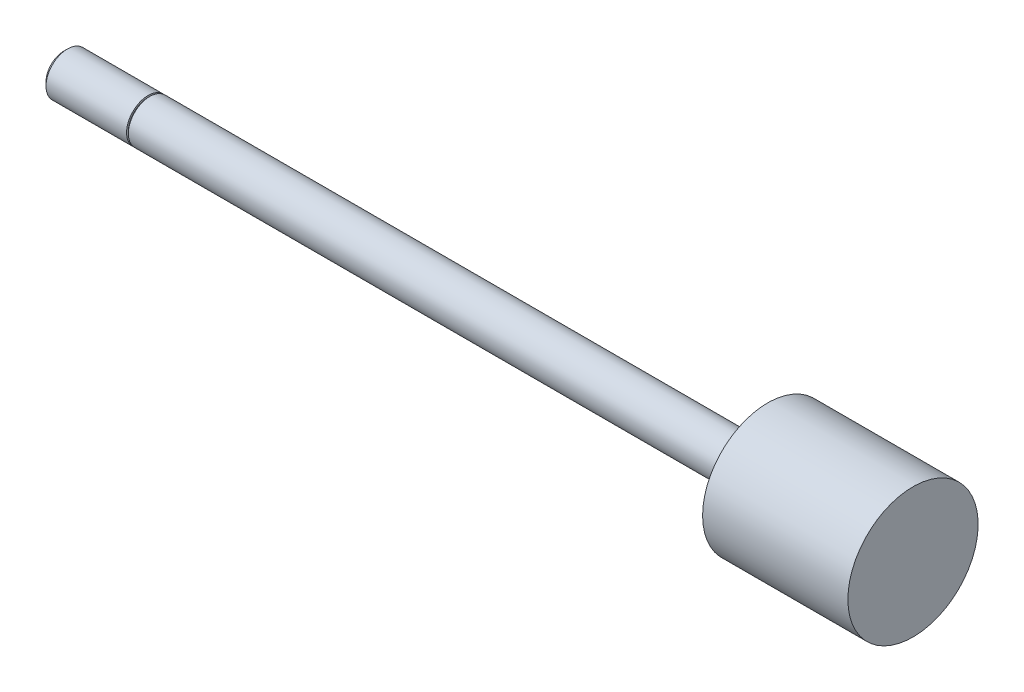
ISO-10303-21;
HEADER;
FILE_DESCRIPTION(('STEP AP214'),'2;1');
FILE_NAME('part.step','',(''),(''),'','','');
FILE_SCHEMA(('AUTOMOTIVE_DESIGN { 1 0 10303 214 1 1 1 1 }'));
ENDSEC;
DATA;
#1=APPLICATION_CONTEXT('core data for automotive mechanical design processes');
#2=APPLICATION_PROTOCOL_DEFINITION('international standard','automotive_design',2000,#1);
#3=PRODUCT_CONTEXT('',#1,'mechanical');
#4=PRODUCT('Part','Part','',(#3));
#5=PRODUCT_RELATED_PRODUCT_CATEGORY('part','',(#4));
#6=PRODUCT_DEFINITION_FORMATION('','',#4);
#7=PRODUCT_DEFINITION_CONTEXT('part definition',#1,'design');
#8=PRODUCT_DEFINITION('design','',#6,#7);
#9=PRODUCT_DEFINITION_SHAPE('','',#8);
#10=(LENGTH_UNIT() NAMED_UNIT(*) SI_UNIT(.MILLI.,.METRE.));
#11=(NAMED_UNIT(*) PLANE_ANGLE_UNIT() SI_UNIT($,.RADIAN.));
#12=(NAMED_UNIT(*) SI_UNIT($,.STERADIAN.) SOLID_ANGLE_UNIT());
#13=UNCERTAINTY_MEASURE_WITH_UNIT(LENGTH_MEASURE(1.E-05),#10,'distance_accuracy_value','');
#14=(GEOMETRIC_REPRESENTATION_CONTEXT(3) GLOBAL_UNCERTAINTY_ASSIGNED_CONTEXT((#13)) GLOBAL_UNIT_ASSIGNED_CONTEXT((#10,
#11,#12)) REPRESENTATION_CONTEXT('',''));
#15=CARTESIAN_POINT('',(0.,0.,0.));
#16=DIRECTION('',(0.,0.,1.));
#17=DIRECTION('',(1.,0.,0.));
#18=AXIS2_PLACEMENT_3D('',#15,#16,#17);
#19=CARTESIAN_POINT('',(112.7506,0.,0.));
#20=DIRECTION('',(-1.,0.,0.));
#21=DIRECTION('',(0.,0.,1.));
#22=AXIS2_PLACEMENT_3D('',#19,#20,#21);
#23=CYLINDRICAL_SURFACE('',#22,3.175);
#24=CARTESIAN_POINT('',(91.2876,0.,0.));
#25=DIRECTION('',(-1.,0.,0.));
#26=DIRECTION('',(0.,0.,1.));
#27=AXIS2_PLACEMENT_3D('',#24,#25,#26);
#28=CIRCLE('',#27,3.175);
#29=CARTESIAN_POINT('',(91.2876,0.,3.175));
#30=VERTEX_POINT('',#29);
#31=EDGE_CURVE('E10',#30,#30,#28,.T.);
#32=ORIENTED_EDGE('',*,*,#31,.T.);
#33=EDGE_LOOP('',(#32));
#34=FACE_BOUND('',#33,.T.);
#35=CARTESIAN_POINT('',(0.,0.,0.));
#36=DIRECTION('',(-1.,0.,0.));
#37=DIRECTION('',(0.,0.,1.));
#38=AXIS2_PLACEMENT_3D('',#35,#36,#37);
#39=CIRCLE('',#38,3.175);
#40=CARTESIAN_POINT('',(0.,0.,3.175));
#41=VERTEX_POINT('',#40);
#42=EDGE_CURVE('E50',#41,#41,#39,.T.);
#43=ORIENTED_EDGE('',*,*,#42,.F.);
#44=EDGE_LOOP('',(#43));
#45=FACE_BOUND('',#44,.T.);
#46=ADVANCED_FACE('F34',(#34,#45),#23,.T.);
#47=CARTESIAN_POINT('',(91.2876,3.175,0.));
#48=DIRECTION('',(1.,0.,0.));
#49=DIRECTION('',(0.,0.,-1.));
#50=AXIS2_PLACEMENT_3D('',#47,#48,#49);
#51=PLANE('',#50);
#52=ORIENTED_EDGE('',*,*,#31,.F.);
#53=EDGE_LOOP('',(#52));
#54=FACE_BOUND('',#53,.T.);
#55=CARTESIAN_POINT('',(91.2876,0.,0.));
#56=DIRECTION('',(-1.,0.,0.));
#57=DIRECTION('',(0.,0.,1.));
#58=AXIS2_PLACEMENT_3D('',#55,#56,#57);
#59=CIRCLE('',#58,9.62025);
#60=CARTESIAN_POINT('',(91.2876,0.,9.62025));
#61=VERTEX_POINT('',#60);
#62=EDGE_CURVE('E42',#61,#61,#59,.T.);
#63=ORIENTED_EDGE('',*,*,#62,.T.);
#64=EDGE_LOOP('',(#63));
#65=FACE_BOUND('',#64,.T.);
#66=ADVANCED_FACE('F84',(#54,#65),#51,.F.);
#67=CARTESIAN_POINT('',(112.7506,0.,0.));
#68=DIRECTION('',(-1.,0.,0.));
#69=DIRECTION('',(0.,0.,1.));
#70=AXIS2_PLACEMENT_3D('',#67,#68,#69);
#71=CYLINDRICAL_SURFACE('',#70,9.62025);
#72=ORIENTED_EDGE('',*,*,#62,.F.);
#73=EDGE_LOOP('',(#72));
#74=FACE_BOUND('',#73,.T.);
#75=CARTESIAN_POINT('',(112.7506,0.,0.));
#76=DIRECTION('',(-1.,0.,0.));
#77=DIRECTION('',(0.,0.,1.));
#78=AXIS2_PLACEMENT_3D('',#75,#76,#77);
#79=CIRCLE('',#78,9.62025);
#80=CARTESIAN_POINT('',(112.7506,0.,9.62025));
#81=VERTEX_POINT('',#80);
#82=EDGE_CURVE('E47',#81,#81,#79,.T.);
#83=ORIENTED_EDGE('',*,*,#82,.T.);
#84=EDGE_LOOP('',(#83));
#85=FACE_BOUND('',#84,.T.);
#86=ADVANCED_FACE('F72',(#74,#85),#71,.T.);
#87=CARTESIAN_POINT('',(112.7506,9.62025,0.));
#88=DIRECTION('',(-1.,0.,0.));
#89=DIRECTION('',(0.,0.,1.));
#90=AXIS2_PLACEMENT_3D('',#87,#88,#89);
#91=PLANE('',#90);
#92=ORIENTED_EDGE('',*,*,#82,.F.);
#93=EDGE_LOOP('',(#92));
#94=FACE_BOUND('',#93,.T.);
#95=ADVANCED_FACE('F74',(#94),#91,.F.);
#96=CARTESIAN_POINT('',(-0.254,3.429,0.));
#97=DIRECTION('',(1.,0.,0.));
#98=DIRECTION('',(0.,0.,-1.));
#99=AXIS2_PLACEMENT_3D('',#96,#97,#98);
#100=PLANE('',#99);
#101=CARTESIAN_POINT('',(-0.254,0.,0.));
#102=DIRECTION('',(-1.,0.,0.));
#103=DIRECTION('',(0.,0.,1.));
#104=AXIS2_PLACEMENT_3D('',#101,#102,#103);
#105=CIRCLE('',#104,2.921);
#106=CARTESIAN_POINT('',(-0.254,0.,2.921));
#107=VERTEX_POINT('',#106);
#108=EDGE_CURVE('E52',#107,#107,#105,.T.);
#109=ORIENTED_EDGE('',*,*,#108,.T.);
#110=EDGE_LOOP('',(#109));
#111=FACE_BOUND('',#110,.T.);
#112=CARTESIAN_POINT('',(-0.254000000000004,0.,0.));
#113=DIRECTION('',(1.,0.,0.));
#114=DIRECTION('',(0.,0.,-1.));
#115=AXIS2_PLACEMENT_3D('',#112,#113,#114);
#116=CIRCLE('',#115,3.175);
#117=CARTESIAN_POINT('',(-0.254000000000004,0.,-3.175));
#118=VERTEX_POINT('',#117);
#119=EDGE_CURVE('E38',#118,#118,#116,.T.);
#120=ORIENTED_EDGE('',*,*,#119,.T.);
#121=EDGE_LOOP('',(#120));
#122=FACE_BOUND('',#121,.T.);
#123=ADVANCED_FACE('F76',(#111,#122),#100,.T.);
#124=CARTESIAN_POINT('',(0.,2.921,0.));
#125=DIRECTION('',(-1.,0.,0.));
#126=DIRECTION('',(0.,0.,1.));
#127=AXIS2_PLACEMENT_3D('',#124,#125,#126);
#128=PLANE('',#127);
#129=CARTESIAN_POINT('',(0.,0.,0.));
#130=DIRECTION('',(-1.,0.,0.));
#131=DIRECTION('',(0.,0.,1.));
#132=AXIS2_PLACEMENT_3D('',#129,#130,#131);
#133=CIRCLE('',#132,2.921);
#134=CARTESIAN_POINT('',(0.,0.,2.921));
#135=VERTEX_POINT('',#134);
#136=EDGE_CURVE('E58',#135,#135,#133,.T.);
#137=ORIENTED_EDGE('',*,*,#136,.F.);
#138=EDGE_LOOP('',(#137));
#139=FACE_BOUND('',#138,.T.);
#140=ORIENTED_EDGE('',*,*,#42,.T.);
#141=EDGE_LOOP('',(#140));
#142=FACE_BOUND('',#141,.T.);
#143=ADVANCED_FACE('F82',(#139,#142),#128,.T.);
#144=CARTESIAN_POINT('',(0.,0.,0.));
#145=DIRECTION('',(-1.,0.,0.));
#146=DIRECTION('',(0.,0.,1.));
#147=AXIS2_PLACEMENT_3D('',#144,#145,#146);
#148=CYLINDRICAL_SURFACE('',#147,2.921);
#149=ORIENTED_EDGE('',*,*,#136,.T.);
#150=EDGE_LOOP('',(#149));
#151=FACE_BOUND('',#150,.T.);
#152=ORIENTED_EDGE('',*,*,#108,.F.);
#153=EDGE_LOOP('',(#152));
#154=FACE_BOUND('',#153,.T.);
#155=ADVANCED_FACE('F111',(#151,#154),#148,.T.);
#156=CARTESIAN_POINT('',(-12.7,0.,0.));
#157=DIRECTION('',(1.,0.,0.));
#158=DIRECTION('',(0.,0.,-1.));
#159=AXIS2_PLACEMENT_3D('',#156,#157,#158);
#160=PLANE('',#159);
#161=CARTESIAN_POINT('',(-12.7,0.,0.));
#162=DIRECTION('',(-1.,0.,0.));
#163=DIRECTION('',(0.,0.,1.));
#164=AXIS2_PLACEMENT_3D('',#161,#162,#163);
#165=CIRCLE('',#164,2.63398);
#166=CARTESIAN_POINT('',(-12.7,0.,2.63398));
#167=VERTEX_POINT('',#166);
#168=EDGE_CURVE('E67',#167,#167,#165,.T.);
#169=ORIENTED_EDGE('',*,*,#168,.T.);
#170=EDGE_LOOP('',(#169));
#171=FACE_BOUND('',#170,.T.);
#172=ADVANCED_FACE('F100',(#171),#160,.F.);
#173=CARTESIAN_POINT('',(-12.15898,0.,0.));
#174=DIRECTION('',(1.,0.,0.));
#175=DIRECTION('',(0.,0.,-1.));
#176=AXIS2_PLACEMENT_3D('',#173,#174,#175);
#177=CONICAL_SURFACE('',#176,3.175,0.785398163397448);
#178=ORIENTED_EDGE('',*,*,#168,.F.);
#179=EDGE_LOOP('',(#178));
#180=FACE_BOUND('',#179,.T.);
#181=CARTESIAN_POINT('',(-12.15898,0.,0.));
#182=DIRECTION('',(-1.,0.,0.));
#183=DIRECTION('',(0.,0.,1.));
#184=AXIS2_PLACEMENT_3D('',#181,#182,#183);
#185=CIRCLE('',#184,3.175);
#186=CARTESIAN_POINT('',(-12.15898,0.,3.175));
#187=VERTEX_POINT('',#186);
#188=EDGE_CURVE('E56',#187,#187,#185,.T.);
#189=ORIENTED_EDGE('',*,*,#188,.T.);
#190=EDGE_LOOP('',(#189));
#191=FACE_BOUND('',#190,.T.);
#192=ADVANCED_FACE('F95',(#180,#191),#177,.T.);
#193=ORIENTED_EDGE('',*,*,#188,.F.);
#194=EDGE_LOOP('',(#193));
#195=FACE_BOUND('',#194,.T.);
#196=ORIENTED_EDGE('',*,*,#119,.F.);
#197=EDGE_LOOP('',(#196));
#198=FACE_BOUND('',#197,.T.);
#199=ADVANCED_FACE('F36',(#195,#198),#23,.T.);
#200=CLOSED_SHELL('',(#46,#66,#86,#95,#123,#143,#155,#172,#192,#199));
#201=MANIFOLD_SOLID_BREP('B2',#200);
#202=ADVANCED_BREP_SHAPE_REPRESENTATION('',(#18,#201),#14);
#203=SHAPE_DEFINITION_REPRESENTATION(#9,#202);
ENDSEC;
END-ISO-10303-21;
